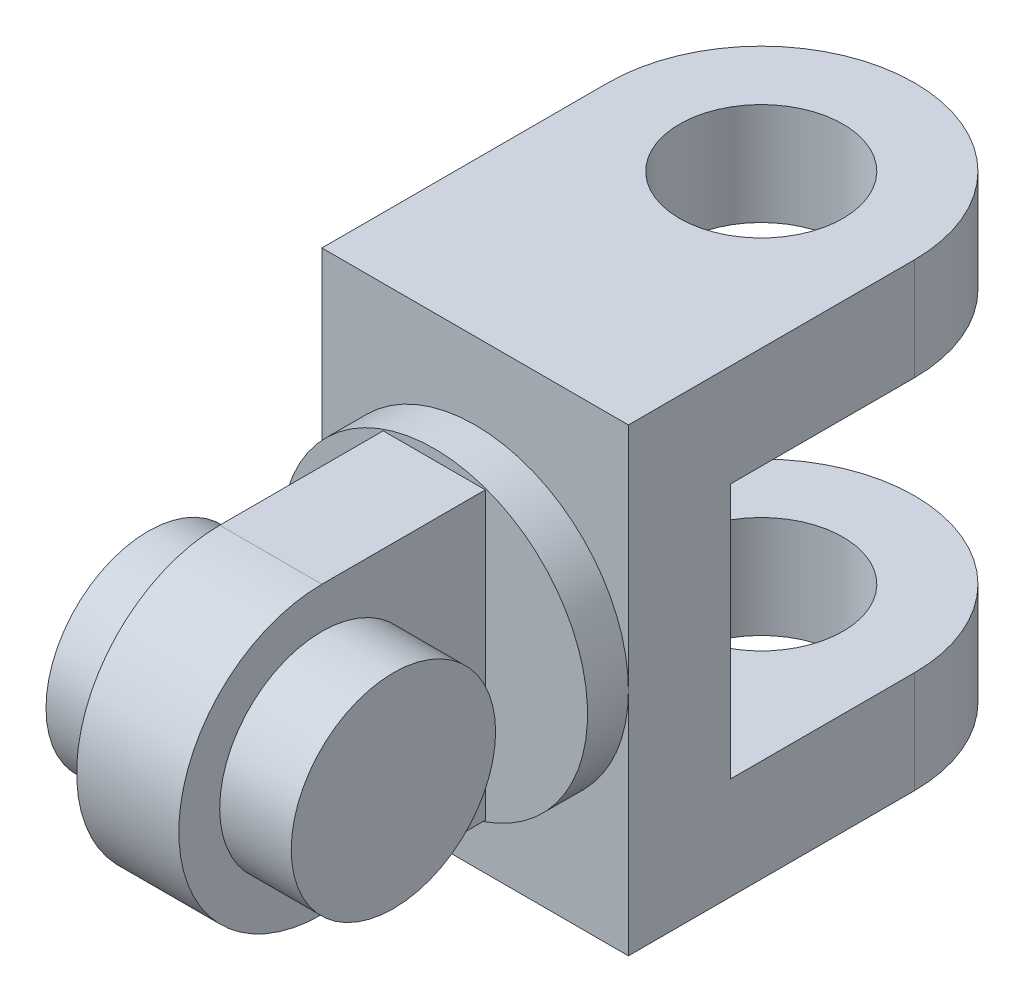
ISO-10303-21;
HEADER;
FILE_DESCRIPTION(('STEP AP214'),'2;1');
FILE_NAME('part.step','',(''),(''),'','','');
FILE_SCHEMA(('AUTOMOTIVE_DESIGN { 1 0 10303 214 1 1 1 1 }'));
ENDSEC;
DATA;
#1=APPLICATION_CONTEXT('core data for automotive mechanical design processes');
#2=APPLICATION_PROTOCOL_DEFINITION('international standard','automotive_design',2000,#1);
#3=PRODUCT_CONTEXT('',#1,'mechanical');
#4=PRODUCT('Part','Part','',(#3));
#5=PRODUCT_RELATED_PRODUCT_CATEGORY('part','',(#4));
#6=PRODUCT_DEFINITION_FORMATION('','',#4);
#7=PRODUCT_DEFINITION_CONTEXT('part definition',#1,'design');
#8=PRODUCT_DEFINITION('design','',#6,#7);
#9=PRODUCT_DEFINITION_SHAPE('','',#8);
#10=(LENGTH_UNIT() NAMED_UNIT(*) SI_UNIT(.MILLI.,.METRE.));
#11=(NAMED_UNIT(*) PLANE_ANGLE_UNIT() SI_UNIT($,.RADIAN.));
#12=(NAMED_UNIT(*) SI_UNIT($,.STERADIAN.) SOLID_ANGLE_UNIT());
#13=UNCERTAINTY_MEASURE_WITH_UNIT(LENGTH_MEASURE(1.E-05),#10,'distance_accuracy_value','');
#14=(GEOMETRIC_REPRESENTATION_CONTEXT(3) GLOBAL_UNCERTAINTY_ASSIGNED_CONTEXT((#13)) GLOBAL_UNIT_ASSIGNED_CONTEXT((#10,
#11,#12)) REPRESENTATION_CONTEXT('',''));
#15=CARTESIAN_POINT('',(0.,0.,0.));
#16=DIRECTION('',(0.,0.,1.));
#17=DIRECTION('',(1.,0.,0.));
#18=AXIS2_PLACEMENT_3D('',#15,#16,#17);
#19=CARTESIAN_POINT('',(15.,-22.5,-30.));
#20=DIRECTION('',(0.,0.,-1.));
#21=DIRECTION('',(-1.,0.,0.));
#22=AXIS2_PLACEMENT_3D('',#19,#20,#21);
#23=PLANE('',#22);
#24=DIRECTION('',(0.,-1.,0.));
#25=VECTOR('',#24,1.);
#26=CARTESIAN_POINT('',(15.,22.5,-30.));
#27=LINE('',#26,#25);
#28=CARTESIAN_POINT('',(15.,12.5,-30.));
#29=VERTEX_POINT('',#28);
#30=CARTESIAN_POINT('',(15.,-12.5,-30.));
#31=VERTEX_POINT('',#30);
#32=EDGE_CURVE('E50',#29,#31,#27,.T.);
#33=ORIENTED_EDGE('',*,*,#32,.T.);
#34=DIRECTION('',(1.,0.,0.));
#35=VECTOR('',#34,1.);
#36=CARTESIAN_POINT('',(-15.,-12.5,-30.));
#37=LINE('',#36,#35);
#38=CARTESIAN_POINT('',(-15.,-12.5,-30.));
#39=VERTEX_POINT('',#38);
#40=EDGE_CURVE('E166',#39,#31,#37,.T.);
#41=ORIENTED_EDGE('',*,*,#40,.F.);
#42=DIRECTION('',(0.,1.,0.));
#43=VECTOR('',#42,1.);
#44=CARTESIAN_POINT('',(-15.,22.5,-30.));
#45=LINE('',#44,#43);
#46=CARTESIAN_POINT('',(-15.,12.5,-30.));
#47=VERTEX_POINT('',#46);
#48=EDGE_CURVE('E36',#39,#47,#45,.T.);
#49=ORIENTED_EDGE('',*,*,#48,.T.);
#50=DIRECTION('',(1.,0.,0.));
#51=VECTOR('',#50,1.);
#52=CARTESIAN_POINT('',(-15.,12.5,-30.));
#53=LINE('',#52,#51);
#54=EDGE_CURVE('E178',#47,#29,#53,.T.);
#55=ORIENTED_EDGE('',*,*,#54,.T.);
#56=EDGE_LOOP('',(#33,#41,#49,#55));
#57=FACE_BOUND('',#56,.T.);
#58=ADVANCED_FACE('F32',(#57),#23,.T.);
#59=CARTESIAN_POINT('',(12.,0.,0.));
#60=DIRECTION('',(-1.,0.,0.));
#61=DIRECTION('',(0.,0.,1.));
#62=AXIS2_PLACEMENT_3D('',#59,#60,#61);
#63=CYLINDRICAL_SURFACE('',#62,10.);
#64=CARTESIAN_POINT('',(5.,0.,0.));
#65=DIRECTION('',(1.,0.,0.));
#66=DIRECTION('',(0.,0.,-1.));
#67=AXIS2_PLACEMENT_3D('',#64,#65,#66);
#68=CIRCLE('',#67,10.);
#69=CARTESIAN_POINT('',(5.,0.,-10.));
#70=VERTEX_POINT('',#69);
#71=EDGE_CURVE('E268',#70,#70,#68,.T.);
#72=ORIENTED_EDGE('',*,*,#71,.T.);
#73=EDGE_LOOP('',(#72));
#74=FACE_BOUND('',#73,.T.);
#75=CARTESIAN_POINT('',(12.,0.,0.));
#76=DIRECTION('',(1.,0.,0.));
#77=DIRECTION('',(0.,0.,-1.));
#78=AXIS2_PLACEMENT_3D('',#75,#76,#77);
#79=CIRCLE('',#78,10.);
#80=CARTESIAN_POINT('',(12.,0.,-10.));
#81=VERTEX_POINT('',#80);
#82=EDGE_CURVE('E42',#81,#81,#79,.T.);
#83=ORIENTED_EDGE('',*,*,#82,.F.);
#84=EDGE_LOOP('',(#83));
#85=FACE_BOUND('',#84,.T.);
#86=ADVANCED_FACE('F34',(#74,#85),#63,.T.);
#87=CARTESIAN_POINT('',(12.,0.,0.));
#88=DIRECTION('',(1.,0.,0.));
#89=DIRECTION('',(0.,0.,-1.));
#90=AXIS2_PLACEMENT_3D('',#87,#88,#89);
#91=PLANE('',#90);
#92=ORIENTED_EDGE('',*,*,#82,.T.);
#93=EDGE_LOOP('',(#92));
#94=FACE_BOUND('',#93,.T.);
#95=ADVANCED_FACE('F281',(#94),#91,.T.);
#96=CARTESIAN_POINT('',(5.,0.,0.));
#97=DIRECTION('',(1.,0.,0.));
#98=DIRECTION('',(0.,0.,-1.));
#99=AXIS2_PLACEMENT_3D('',#96,#97,#98);
#100=PLANE('',#99);
#101=CARTESIAN_POINT('',(5.,0.,0.));
#102=DIRECTION('',(1.,0.,0.));
#103=DIRECTION('',(0.,0.,-1.));
#104=AXIS2_PLACEMENT_3D('',#101,#102,#103);
#105=CIRCLE('',#104,14.);
#106=CARTESIAN_POINT('',(5.,14.,0.));
#107=VERTEX_POINT('',#106);
#108=CARTESIAN_POINT('',(5.,-14.,0.));
#109=VERTEX_POINT('',#108);
#110=EDGE_CURVE('E237',#107,#109,#105,.T.);
#111=ORIENTED_EDGE('',*,*,#110,.T.);
#112=DIRECTION('',(0.,0.,-1.));
#113=VECTOR('',#112,1.);
#114=CARTESIAN_POINT('',(5.,-14.,-16.));
#115=LINE('',#114,#113);
#116=CARTESIAN_POINT('',(5.,-14.,-16.));
#117=VERTEX_POINT('',#116);
#118=EDGE_CURVE('E240',#109,#117,#115,.T.);
#119=ORIENTED_EDGE('',*,*,#118,.T.);
#120=DIRECTION('',(0.,1.,0.));
#121=VECTOR('',#120,1.);
#122=CARTESIAN_POINT('',(5.,14.,-16.));
#123=LINE('',#122,#121);
#124=CARTESIAN_POINT('',(5.,14.,-16.));
#125=VERTEX_POINT('',#124);
#126=EDGE_CURVE('E244',#117,#125,#123,.T.);
#127=ORIENTED_EDGE('',*,*,#126,.T.);
#128=DIRECTION('',(0.,0.,1.));
#129=VECTOR('',#128,1.);
#130=CARTESIAN_POINT('',(5.,14.,0.));
#131=LINE('',#130,#129);
#132=EDGE_CURVE('E247',#125,#107,#131,.T.);
#133=ORIENTED_EDGE('',*,*,#132,.T.);
#134=EDGE_LOOP('',(#111,#119,#127,#133));
#135=FACE_BOUND('',#134,.T.);
#136=ORIENTED_EDGE('',*,*,#71,.F.);
#137=EDGE_LOOP('',(#136));
#138=FACE_BOUND('',#137,.T.);
#139=ADVANCED_FACE('F278',(#135,#138),#100,.T.);
#140=CARTESIAN_POINT('',(-5.,0.,0.));
#141=DIRECTION('',(1.,0.,0.));
#142=DIRECTION('',(0.,0.,-1.));
#143=AXIS2_PLACEMENT_3D('',#140,#141,#142);
#144=PLANE('',#143);
#145=CARTESIAN_POINT('',(-5.,0.,0.));
#146=DIRECTION('',(1.,0.,0.));
#147=DIRECTION('',(0.,0.,-1.));
#148=AXIS2_PLACEMENT_3D('',#145,#146,#147);
#149=CIRCLE('',#148,14.);
#150=CARTESIAN_POINT('',(-5.,14.,0.));
#151=VERTEX_POINT('',#150);
#152=CARTESIAN_POINT('',(-5.,-14.,0.));
#153=VERTEX_POINT('',#152);
#154=EDGE_CURVE('E233',#151,#153,#149,.T.);
#155=ORIENTED_EDGE('',*,*,#154,.F.);
#156=DIRECTION('',(0.,0.,1.));
#157=VECTOR('',#156,1.);
#158=CARTESIAN_POINT('',(-5.,14.,0.));
#159=LINE('',#158,#157);
#160=CARTESIAN_POINT('',(-5.,14.,-16.));
#161=VERTEX_POINT('',#160);
#162=EDGE_CURVE('E241',#161,#151,#159,.T.);
#163=ORIENTED_EDGE('',*,*,#162,.F.);
#164=DIRECTION('',(0.,1.,0.));
#165=VECTOR('',#164,1.);
#166=CARTESIAN_POINT('',(-5.,14.,-16.));
#167=LINE('',#166,#165);
#168=CARTESIAN_POINT('',(-5.,-14.,-16.));
#169=VERTEX_POINT('',#168);
#170=EDGE_CURVE('E255',#169,#161,#167,.T.);
#171=ORIENTED_EDGE('',*,*,#170,.F.);
#172=DIRECTION('',(0.,0.,-1.));
#173=VECTOR('',#172,1.);
#174=CARTESIAN_POINT('',(-5.,-14.,-16.));
#175=LINE('',#174,#173);
#176=EDGE_CURVE('E252',#153,#169,#175,.T.);
#177=ORIENTED_EDGE('',*,*,#176,.F.);
#178=EDGE_LOOP('',(#155,#163,#171,#177));
#179=FACE_BOUND('',#178,.T.);
#180=CARTESIAN_POINT('',(-5.,0.,0.));
#181=DIRECTION('',(1.,0.,0.));
#182=DIRECTION('',(0.,0.,-1.));
#183=AXIS2_PLACEMENT_3D('',#180,#181,#182);
#184=CIRCLE('',#183,10.);
#185=CARTESIAN_POINT('',(-5.,0.,-10.));
#186=VERTEX_POINT('',#185);
#187=EDGE_CURVE('E11',#186,#186,#184,.T.);
#188=ORIENTED_EDGE('',*,*,#187,.T.);
#189=EDGE_LOOP('',(#188));
#190=FACE_BOUND('',#189,.T.);
#191=ADVANCED_FACE('F280',(#179,#190),#144,.F.);
#192=CARTESIAN_POINT('',(5.,0.,0.));
#193=DIRECTION('',(-1.,0.,0.));
#194=DIRECTION('',(0.,0.,1.));
#195=AXIS2_PLACEMENT_3D('',#192,#193,#194);
#196=CYLINDRICAL_SURFACE('',#195,14.);
#197=ORIENTED_EDGE('',*,*,#154,.T.);
#198=DIRECTION('',(-1.,0.,0.));
#199=VECTOR('',#198,1.);
#200=CARTESIAN_POINT('',(5.,-14.,0.));
#201=LINE('',#200,#199);
#202=EDGE_CURVE('E265',#109,#153,#201,.T.);
#203=ORIENTED_EDGE('',*,*,#202,.F.);
#204=ORIENTED_EDGE('',*,*,#110,.F.);
#205=DIRECTION('',(-1.,0.,0.));
#206=VECTOR('',#205,1.);
#207=CARTESIAN_POINT('',(5.,14.,0.));
#208=LINE('',#207,#206);
#209=EDGE_CURVE('E249',#107,#151,#208,.T.);
#210=ORIENTED_EDGE('',*,*,#209,.T.);
#211=EDGE_LOOP('',(#197,#203,#204,#210));
#212=FACE_BOUND('',#211,.T.);
#213=ADVANCED_FACE('F288',(#212),#196,.T.);
#214=CARTESIAN_POINT('',(5.,-14.,-16.));
#215=DIRECTION('',(0.,1.,0.));
#216=DIRECTION('',(0.,0.,1.));
#217=AXIS2_PLACEMENT_3D('',#214,#215,#216);
#218=PLANE('',#217);
#219=ORIENTED_EDGE('',*,*,#176,.T.);
#220=DIRECTION('',(-1.,0.,0.));
#221=VECTOR('',#220,1.);
#222=CARTESIAN_POINT('',(5.,-14.,-16.));
#223=LINE('',#222,#221);
#224=EDGE_CURVE('E263',#117,#169,#223,.T.);
#225=ORIENTED_EDGE('',*,*,#224,.F.);
#226=ORIENTED_EDGE('',*,*,#118,.F.);
#227=ORIENTED_EDGE('',*,*,#202,.T.);
#228=EDGE_LOOP('',(#219,#225,#226,#227));
#229=FACE_BOUND('',#228,.T.);
#230=ADVANCED_FACE('F334',(#229),#218,.F.);
#231=CARTESIAN_POINT('',(5.,14.,0.));
#232=DIRECTION('',(0.,-1.,0.));
#233=DIRECTION('',(0.,0.,-1.));
#234=AXIS2_PLACEMENT_3D('',#231,#232,#233);
#235=PLANE('',#234);
#236=ORIENTED_EDGE('',*,*,#162,.T.);
#237=ORIENTED_EDGE('',*,*,#209,.F.);
#238=ORIENTED_EDGE('',*,*,#132,.F.);
#239=DIRECTION('',(-1.,0.,0.));
#240=VECTOR('',#239,1.);
#241=CARTESIAN_POINT('',(5.,14.,-16.));
#242=LINE('',#241,#240);
#243=EDGE_CURVE('E260',#125,#161,#242,.T.);
#244=ORIENTED_EDGE('',*,*,#243,.T.);
#245=EDGE_LOOP('',(#236,#237,#238,#244));
#246=FACE_BOUND('',#245,.T.);
#247=ADVANCED_FACE('F340',(#246),#235,.F.);
#248=CARTESIAN_POINT('',(-12.,0.,0.));
#249=DIRECTION('',(1.,0.,0.));
#250=DIRECTION('',(0.,0.,-1.));
#251=AXIS2_PLACEMENT_3D('',#248,#249,#250);
#252=PLANE('',#251);
#253=CARTESIAN_POINT('',(-12.,0.,0.));
#254=DIRECTION('',(1.,0.,0.));
#255=DIRECTION('',(0.,0.,-1.));
#256=AXIS2_PLACEMENT_3D('',#253,#254,#255);
#257=CIRCLE('',#256,10.);
#258=CARTESIAN_POINT('',(-12.,0.,-10.));
#259=VERTEX_POINT('',#258);
#260=EDGE_CURVE('E271',#259,#259,#257,.T.);
#261=ORIENTED_EDGE('',*,*,#260,.F.);
#262=EDGE_LOOP('',(#261));
#263=FACE_BOUND('',#262,.T.);
#264=ADVANCED_FACE('F350',(#263),#252,.F.);
#265=ORIENTED_EDGE('',*,*,#260,.T.);
#266=EDGE_LOOP('',(#265));
#267=FACE_BOUND('',#266,.T.);
#268=ORIENTED_EDGE('',*,*,#187,.F.);
#269=EDGE_LOOP('',(#268));
#270=FACE_BOUND('',#269,.T.);
#271=ADVANCED_FACE('F299',(#267,#270),#63,.T.);
#272=CARTESIAN_POINT('',(0.,0.,-16.));
#273=DIRECTION('',(0.,0.,-1.));
#274=DIRECTION('',(-1.,0.,0.));
#275=AXIS2_PLACEMENT_3D('',#272,#273,#274);
#276=PLANE('',#275);
#277=CARTESIAN_POINT('',(0.,0.,-16.));
#278=DIRECTION('',(0.,0.,-1.));
#279=DIRECTION('',(-1.,0.,0.));
#280=AXIS2_PLACEMENT_3D('',#277,#278,#279);
#281=CIRCLE('',#280,15.);
#282=CARTESIAN_POINT('',(-15.,0.,-16.));
#283=VERTEX_POINT('',#282);
#284=EDGE_CURVE('E142',#283,#283,#281,.T.);
#285=ORIENTED_EDGE('',*,*,#284,.F.);
#286=EDGE_LOOP('',(#285));
#287=FACE_BOUND('',#286,.T.);
#288=ORIENTED_EDGE('',*,*,#126,.F.);
#289=ORIENTED_EDGE('',*,*,#224,.T.);
#290=ORIENTED_EDGE('',*,*,#170,.T.);
#291=ORIENTED_EDGE('',*,*,#243,.F.);
#292=EDGE_LOOP('',(#288,#289,#290,#291));
#293=FACE_BOUND('',#292,.T.);
#294=ADVANCED_FACE('F318',(#287,#293),#276,.F.);
#295=CARTESIAN_POINT('',(0.,0.,-20.));
#296=DIRECTION('',(0.,0.,1.));
#297=DIRECTION('',(1.,0.,0.));
#298=AXIS2_PLACEMENT_3D('',#295,#296,#297);
#299=CYLINDRICAL_SURFACE('',#298,15.);
#300=CARTESIAN_POINT('',(0.,0.,-20.));
#301=DIRECTION('',(0.,0.,-1.));
#302=DIRECTION('',(-1.,0.,0.));
#303=AXIS2_PLACEMENT_3D('',#300,#301,#302);
#304=CIRCLE('',#303,15.);
#305=CARTESIAN_POINT('',(-15.,0.,-20.));
#306=VERTEX_POINT('',#305);
#307=CARTESIAN_POINT('',(15.,0.,-20.));
#308=VERTEX_POINT('',#307);
#309=EDGE_CURVE('E230',#306,#308,#304,.T.);
#310=ORIENTED_EDGE('',*,*,#309,.F.);
#311=EDGE_CURVE('E234',#308,#306,#304,.T.);
#312=ORIENTED_EDGE('',*,*,#311,.F.);
#313=EDGE_LOOP('',(#310,#312));
#314=FACE_BOUND('',#313,.T.);
#315=ORIENTED_EDGE('',*,*,#284,.T.);
#316=EDGE_LOOP('',(#315));
#317=FACE_BOUND('',#316,.T.);
#318=ADVANCED_FACE('F307',(#314,#317),#299,.T.);
#319=CARTESIAN_POINT('',(15.,-22.5,-20.));
#320=DIRECTION('',(0.,0.,-1.));
#321=DIRECTION('',(-1.,0.,0.));
#322=AXIS2_PLACEMENT_3D('',#319,#320,#321);
#323=PLANE('',#322);
#324=DIRECTION('',(0.,1.,0.));
#325=VECTOR('',#324,1.);
#326=CARTESIAN_POINT('',(-15.,22.5,-20.));
#327=LINE('',#326,#325);
#328=CARTESIAN_POINT('',(-15.,22.5,-20.));
#329=VERTEX_POINT('',#328);
#330=EDGE_CURVE('E223',#306,#329,#327,.T.);
#331=ORIENTED_EDGE('',*,*,#330,.F.);
#332=ORIENTED_EDGE('',*,*,#309,.T.);
#333=DIRECTION('',(0.,-1.,0.));
#334=VECTOR('',#333,1.);
#335=CARTESIAN_POINT('',(15.,22.5,-20.));
#336=LINE('',#335,#334);
#337=CARTESIAN_POINT('',(15.,22.5,-20.));
#338=VERTEX_POINT('',#337);
#339=EDGE_CURVE('E527',#338,#308,#336,.T.);
#340=ORIENTED_EDGE('',*,*,#339,.F.);
#341=DIRECTION('',(1.,0.,0.));
#342=VECTOR('',#341,1.);
#343=CARTESIAN_POINT('',(15.,22.5,-20.));
#344=LINE('',#343,#342);
#345=EDGE_CURVE('E216',#329,#338,#344,.T.);
#346=ORIENTED_EDGE('',*,*,#345,.F.);
#347=EDGE_LOOP('',(#331,#332,#340,#346));
#348=FACE_BOUND('',#347,.T.);
#349=ADVANCED_FACE('F303',(#348),#323,.F.);
#350=CARTESIAN_POINT('',(15.,-22.5,-20.));
#351=VERTEX_POINT('',#350);
#352=EDGE_CURVE('E138',#308,#351,#336,.T.);
#353=ORIENTED_EDGE('',*,*,#352,.F.);
#354=ORIENTED_EDGE('',*,*,#311,.T.);
#355=CARTESIAN_POINT('',(-15.,-22.5,-20.));
#356=VERTEX_POINT('',#355);
#357=EDGE_CURVE('E218',#356,#306,#327,.T.);
#358=ORIENTED_EDGE('',*,*,#357,.F.);
#359=DIRECTION('',(-1.,0.,0.));
#360=VECTOR('',#359,1.);
#361=CARTESIAN_POINT('',(15.,-22.5,-20.));
#362=LINE('',#361,#360);
#363=EDGE_CURVE('E524',#351,#356,#362,.T.);
#364=ORIENTED_EDGE('',*,*,#363,.F.);
#365=EDGE_LOOP('',(#353,#354,#358,#364));
#366=FACE_BOUND('',#365,.T.);
#367=ADVANCED_FACE('F306',(#366),#323,.F.);
#368=CARTESIAN_POINT('',(15.,22.5,-30.));
#369=DIRECTION('',(-1.,0.,0.));
#370=DIRECTION('',(0.,-1.,0.));
#371=AXIS2_PLACEMENT_3D('',#368,#369,#370);
#372=PLANE('',#371);
#373=ORIENTED_EDGE('',*,*,#339,.T.);
#374=ORIENTED_EDGE('',*,*,#352,.T.);
#375=DIRECTION('',(0.,0.,1.));
#376=VECTOR('',#375,1.);
#377=CARTESIAN_POINT('',(15.,-22.5,-30.));
#378=LINE('',#377,#376);
#379=CARTESIAN_POINT('',(15.,-22.5,-48.));
#380=VERTEX_POINT('',#379);
#381=EDGE_CURVE('E131',#380,#351,#378,.T.);
#382=ORIENTED_EDGE('',*,*,#381,.F.);
#383=DIRECTION('',(0.,1.,0.));
#384=VECTOR('',#383,1.);
#385=CARTESIAN_POINT('',(15.,-22.5,-48.));
#386=LINE('',#385,#384);
#387=CARTESIAN_POINT('',(15.,-12.5,-48.));
#388=VERTEX_POINT('',#387);
#389=EDGE_CURVE('E135',#380,#388,#386,.T.);
#390=ORIENTED_EDGE('',*,*,#389,.T.);
#391=DIRECTION('',(0.,0.,-1.));
#392=VECTOR('',#391,1.);
#393=CARTESIAN_POINT('',(15.,-12.5,-48.));
#394=LINE('',#393,#392);
#395=EDGE_CURVE('E169',#31,#388,#394,.T.);
#396=ORIENTED_EDGE('',*,*,#395,.F.);
#397=ORIENTED_EDGE('',*,*,#32,.F.);
#398=DIRECTION('',(0.,0.,-1.));
#399=VECTOR('',#398,1.);
#400=CARTESIAN_POINT('',(15.,12.5,-48.));
#401=LINE('',#400,#399);
#402=CARTESIAN_POINT('',(15.,12.5,-48.));
#403=VERTEX_POINT('',#402);
#404=EDGE_CURVE('E58',#29,#403,#401,.T.);
#405=ORIENTED_EDGE('',*,*,#404,.T.);
#406=DIRECTION('',(0.,-1.,0.));
#407=VECTOR('',#406,1.);
#408=CARTESIAN_POINT('',(15.,22.5,-48.));
#409=LINE('',#408,#407);
#410=CARTESIAN_POINT('',(15.,22.5,-48.));
#411=VERTEX_POINT('',#410);
#412=EDGE_CURVE('E209',#411,#403,#409,.T.);
#413=ORIENTED_EDGE('',*,*,#412,.F.);
#414=DIRECTION('',(0.,0.,1.));
#415=VECTOR('',#414,1.);
#416=CARTESIAN_POINT('',(15.,22.5,-30.));
#417=LINE('',#416,#415);
#418=EDGE_CURVE('E217',#411,#338,#417,.T.);
#419=ORIENTED_EDGE('',*,*,#418,.T.);
#420=EDGE_LOOP('',(#373,#374,#382,#390,#396,#397,#405,#413,#419));
#421=FACE_BOUND('',#420,.T.);
#422=ADVANCED_FACE('F134',(#421),#372,.F.);
#423=CARTESIAN_POINT('',(15.,-22.5,-30.));
#424=DIRECTION('',(0.,1.,0.));
#425=DIRECTION('',(0.,0.,1.));
#426=AXIS2_PLACEMENT_3D('',#423,#424,#425);
#427=PLANE('',#426);
#428=ORIENTED_EDGE('',*,*,#363,.T.);
#429=DIRECTION('',(0.,0.,1.));
#430=VECTOR('',#429,1.);
#431=CARTESIAN_POINT('',(-15.,-22.5,-30.));
#432=LINE('',#431,#430);
#433=CARTESIAN_POINT('',(-15.,-22.5,-48.));
#434=VERTEX_POINT('',#433);
#435=EDGE_CURVE('E143',#434,#356,#432,.T.);
#436=ORIENTED_EDGE('',*,*,#435,.F.);
#437=CARTESIAN_POINT('',(0.,-22.5,-48.));
#438=DIRECTION('',(0.,1.,0.));
#439=DIRECTION('',(0.,0.,-1.));
#440=AXIS2_PLACEMENT_3D('',#437,#438,#439);
#441=CIRCLE('',#440,15.);
#442=EDGE_CURVE('E148',#380,#434,#441,.T.);
#443=ORIENTED_EDGE('',*,*,#442,.F.);
#444=ORIENTED_EDGE('',*,*,#381,.T.);
#445=EDGE_LOOP('',(#428,#436,#443,#444));
#446=FACE_BOUND('',#445,.T.);
#447=CARTESIAN_POINT('',(0.,-22.5,-48.));
#448=DIRECTION('',(0.,1.,0.));
#449=DIRECTION('',(0.,0.,1.));
#450=AXIS2_PLACEMENT_3D('',#447,#448,#449);
#451=CIRCLE('',#450,8.);
#452=CARTESIAN_POINT('',(0.,-22.5,-40.));
#453=VERTEX_POINT('',#452);
#454=EDGE_CURVE('E170',#453,#453,#451,.T.);
#455=ORIENTED_EDGE('',*,*,#454,.T.);
#456=EDGE_LOOP('',(#455));
#457=FACE_BOUND('',#456,.T.);
#458=ADVANCED_FACE('F154',(#446,#457),#427,.F.);
#459=CARTESIAN_POINT('',(-15.,22.5,-30.));
#460=DIRECTION('',(1.,0.,0.));
#461=DIRECTION('',(0.,1.,0.));
#462=AXIS2_PLACEMENT_3D('',#459,#460,#461);
#463=PLANE('',#462);
#464=ORIENTED_EDGE('',*,*,#357,.T.);
#465=ORIENTED_EDGE('',*,*,#330,.T.);
#466=DIRECTION('',(0.,0.,1.));
#467=VECTOR('',#466,1.);
#468=CARTESIAN_POINT('',(-15.,22.5,-30.));
#469=LINE('',#468,#467);
#470=CARTESIAN_POINT('',(-15.,22.5,-48.));
#471=VERTEX_POINT('',#470);
#472=EDGE_CURVE('E213',#471,#329,#469,.T.);
#473=ORIENTED_EDGE('',*,*,#472,.F.);
#474=DIRECTION('',(0.,-1.,0.));
#475=VECTOR('',#474,1.);
#476=CARTESIAN_POINT('',(-15.,22.5,-48.));
#477=LINE('',#476,#475);
#478=CARTESIAN_POINT('',(-15.,12.5,-48.));
#479=VERTEX_POINT('',#478);
#480=EDGE_CURVE('E184',#471,#479,#477,.T.);
#481=ORIENTED_EDGE('',*,*,#480,.T.);
#482=DIRECTION('',(0.,0.,1.));
#483=VECTOR('',#482,1.);
#484=CARTESIAN_POINT('',(-15.,12.5,-30.));
#485=LINE('',#484,#483);
#486=EDGE_CURVE('E185',#479,#47,#485,.T.);
#487=ORIENTED_EDGE('',*,*,#486,.T.);
#488=ORIENTED_EDGE('',*,*,#48,.F.);
#489=DIRECTION('',(0.,0.,1.));
#490=VECTOR('',#489,1.);
#491=CARTESIAN_POINT('',(-15.,-12.5,-30.));
#492=LINE('',#491,#490);
#493=CARTESIAN_POINT('',(-15.,-12.5,-48.));
#494=VERTEX_POINT('',#493);
#495=EDGE_CURVE('E158',#494,#39,#492,.T.);
#496=ORIENTED_EDGE('',*,*,#495,.F.);
#497=DIRECTION('',(0.,1.,0.));
#498=VECTOR('',#497,1.);
#499=CARTESIAN_POINT('',(-15.,-22.5,-48.));
#500=LINE('',#499,#498);
#501=EDGE_CURVE('E152',#434,#494,#500,.T.);
#502=ORIENTED_EDGE('',*,*,#501,.F.);
#503=ORIENTED_EDGE('',*,*,#435,.T.);
#504=EDGE_LOOP('',(#464,#465,#473,#481,#487,#488,#496,#502,#503));
#505=FACE_BOUND('',#504,.T.);
#506=ADVANCED_FACE('F211',(#505),#463,.F.);
#507=CARTESIAN_POINT('',(15.,22.5,-30.));
#508=DIRECTION('',(0.,-1.,0.));
#509=DIRECTION('',(0.,0.,-1.));
#510=AXIS2_PLACEMENT_3D('',#507,#508,#509);
#511=PLANE('',#510);
#512=ORIENTED_EDGE('',*,*,#345,.T.);
#513=ORIENTED_EDGE('',*,*,#418,.F.);
#514=CARTESIAN_POINT('',(0.,22.5,-48.));
#515=DIRECTION('',(0.,1.,0.));
#516=DIRECTION('',(0.,0.,-1.));
#517=AXIS2_PLACEMENT_3D('',#514,#515,#516);
#518=CIRCLE('',#517,15.);
#519=EDGE_CURVE('E181',#411,#471,#518,.T.);
#520=ORIENTED_EDGE('',*,*,#519,.T.);
#521=ORIENTED_EDGE('',*,*,#472,.T.);
#522=EDGE_LOOP('',(#512,#513,#520,#521));
#523=FACE_BOUND('',#522,.T.);
#524=CARTESIAN_POINT('',(0.,22.5,-48.));
#525=DIRECTION('',(0.,1.,0.));
#526=DIRECTION('',(0.,0.,1.));
#527=AXIS2_PLACEMENT_3D('',#524,#525,#526);
#528=CIRCLE('',#527,8.);
#529=CARTESIAN_POINT('',(0.,22.5,-40.));
#530=VERTEX_POINT('',#529);
#531=EDGE_CURVE('E175',#530,#530,#528,.T.);
#532=ORIENTED_EDGE('',*,*,#531,.F.);
#533=EDGE_LOOP('',(#532));
#534=FACE_BOUND('',#533,.T.);
#535=ADVANCED_FACE('F309',(#523,#534),#511,.F.);
#536=CARTESIAN_POINT('',(0.,12.5,-48.));
#537=DIRECTION('',(0.,-1.,0.));
#538=DIRECTION('',(0.,0.,-1.));
#539=AXIS2_PLACEMENT_3D('',#536,#537,#538);
#540=PLANE('',#539);
#541=ORIENTED_EDGE('',*,*,#54,.F.);
#542=ORIENTED_EDGE('',*,*,#486,.F.);
#543=CARTESIAN_POINT('',(0.,12.5,-48.));
#544=DIRECTION('',(0.,1.,0.));
#545=DIRECTION('',(0.,0.,-1.));
#546=AXIS2_PLACEMENT_3D('',#543,#544,#545);
#547=CIRCLE('',#546,15.);
#548=EDGE_CURVE('E188',#403,#479,#547,.T.);
#549=ORIENTED_EDGE('',*,*,#548,.F.);
#550=ORIENTED_EDGE('',*,*,#404,.F.);
#551=EDGE_LOOP('',(#541,#542,#549,#550));
#552=FACE_BOUND('',#551,.T.);
#553=CARTESIAN_POINT('',(0.,12.5,-48.));
#554=DIRECTION('',(0.,1.,0.));
#555=DIRECTION('',(0.,0.,1.));
#556=AXIS2_PLACEMENT_3D('',#553,#554,#555);
#557=CIRCLE('',#556,8.);
#558=CARTESIAN_POINT('',(0.,12.5,-40.));
#559=VERTEX_POINT('',#558);
#560=EDGE_CURVE('E173',#559,#559,#557,.T.);
#561=ORIENTED_EDGE('',*,*,#560,.T.);
#562=EDGE_LOOP('',(#561));
#563=FACE_BOUND('',#562,.T.);
#564=ADVANCED_FACE('F214',(#552,#563),#540,.T.);
#565=CARTESIAN_POINT('',(0.,22.5,-48.));
#566=DIRECTION('',(0.,-1.,0.));
#567=DIRECTION('',(0.,0.,-1.));
#568=AXIS2_PLACEMENT_3D('',#565,#566,#567);
#569=CYLINDRICAL_SURFACE('',#568,15.);
#570=ORIENTED_EDGE('',*,*,#548,.T.);
#571=ORIENTED_EDGE('',*,*,#480,.F.);
#572=ORIENTED_EDGE('',*,*,#519,.F.);
#573=ORIENTED_EDGE('',*,*,#412,.T.);
#574=EDGE_LOOP('',(#570,#571,#572,#573));
#575=FACE_BOUND('',#574,.T.);
#576=ADVANCED_FACE('F206',(#575),#569,.T.);
#577=CARTESIAN_POINT('',(0.,22.5,-48.));
#578=DIRECTION('',(0.,-1.,0.));
#579=DIRECTION('',(0.,0.,-1.));
#580=AXIS2_PLACEMENT_3D('',#577,#578,#579);
#581=CYLINDRICAL_SURFACE('',#580,8.);
#582=ORIENTED_EDGE('',*,*,#531,.T.);
#583=EDGE_LOOP('',(#582));
#584=FACE_BOUND('',#583,.T.);
#585=ORIENTED_EDGE('',*,*,#560,.F.);
#586=EDGE_LOOP('',(#585));
#587=FACE_BOUND('',#586,.T.);
#588=ADVANCED_FACE('F452',(#584,#587),#581,.F.);
#589=CARTESIAN_POINT('',(0.,-22.5,-48.));
#590=DIRECTION('',(0.,1.,0.));
#591=DIRECTION('',(0.,0.,1.));
#592=AXIS2_PLACEMENT_3D('',#589,#590,#591);
#593=CYLINDRICAL_SURFACE('',#592,15.);
#594=CARTESIAN_POINT('',(0.,-12.5,-48.));
#595=DIRECTION('',(0.,1.,0.));
#596=DIRECTION('',(0.,0.,-1.));
#597=AXIS2_PLACEMENT_3D('',#594,#595,#596);
#598=CIRCLE('',#597,15.);
#599=EDGE_CURVE('E150',#388,#494,#598,.T.);
#600=ORIENTED_EDGE('',*,*,#599,.F.);
#601=ORIENTED_EDGE('',*,*,#389,.F.);
#602=ORIENTED_EDGE('',*,*,#442,.T.);
#603=ORIENTED_EDGE('',*,*,#501,.T.);
#604=EDGE_LOOP('',(#600,#601,#602,#603));
#605=FACE_BOUND('',#604,.T.);
#606=ADVANCED_FACE('F147',(#605),#593,.T.);
#607=CARTESIAN_POINT('',(0.,-12.5,-48.));
#608=DIRECTION('',(0.,-1.,0.));
#609=DIRECTION('',(0.,0.,-1.));
#610=AXIS2_PLACEMENT_3D('',#607,#608,#609);
#611=PLANE('',#610);
#612=CARTESIAN_POINT('',(0.,-12.5,-48.));
#613=DIRECTION('',(0.,1.,0.));
#614=DIRECTION('',(0.,0.,1.));
#615=AXIS2_PLACEMENT_3D('',#612,#613,#614);
#616=CIRCLE('',#615,8.);
#617=CARTESIAN_POINT('',(0.,-12.5,-40.));
#618=VERTEX_POINT('',#617);
#619=EDGE_CURVE('E164',#618,#618,#616,.T.);
#620=ORIENTED_EDGE('',*,*,#619,.F.);
#621=EDGE_LOOP('',(#620));
#622=FACE_BOUND('',#621,.T.);
#623=ORIENTED_EDGE('',*,*,#40,.T.);
#624=ORIENTED_EDGE('',*,*,#395,.T.);
#625=ORIENTED_EDGE('',*,*,#599,.T.);
#626=ORIENTED_EDGE('',*,*,#495,.T.);
#627=EDGE_LOOP('',(#623,#624,#625,#626));
#628=FACE_BOUND('',#627,.T.);
#629=ADVANCED_FACE('F493',(#622,#628),#611,.F.);
#630=CARTESIAN_POINT('',(0.,-22.5,-48.));
#631=DIRECTION('',(0.,1.,0.));
#632=DIRECTION('',(0.,0.,1.));
#633=AXIS2_PLACEMENT_3D('',#630,#631,#632);
#634=CYLINDRICAL_SURFACE('',#633,8.);
#635=ORIENTED_EDGE('',*,*,#454,.F.);
#636=EDGE_LOOP('',(#635));
#637=FACE_BOUND('',#636,.T.);
#638=ORIENTED_EDGE('',*,*,#619,.T.);
#639=EDGE_LOOP('',(#638));
#640=FACE_BOUND('',#639,.T.);
#641=ADVANCED_FACE('F502',(#637,#640),#634,.F.);
#642=CLOSED_SHELL('',(#58,#86,#95,#139,#191,#213,#230,#247,#264,#271,#294,#318,#349,#367,#422,
#458,#506,#535,#564,#576,#588,#606,#629,#641));
#643=MANIFOLD_SOLID_BREP('B2',#642);
#644=ADVANCED_BREP_SHAPE_REPRESENTATION('',(#18,#643),#14);
#645=SHAPE_DEFINITION_REPRESENTATION(#9,#644);
ENDSEC;
END-ISO-10303-21;
